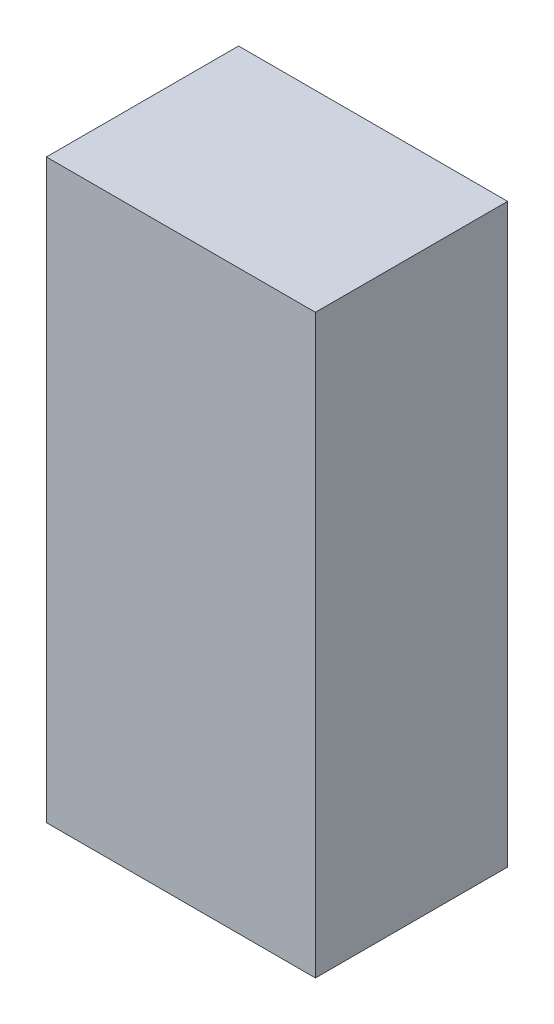
ISO-10303-21;
HEADER;
FILE_DESCRIPTION(('STEP AP214'),'2;1');
FILE_NAME('part.step','',(''),(''),'','','');
FILE_SCHEMA(('AUTOMOTIVE_DESIGN { 1 0 10303 214 1 1 1 1 }'));
ENDSEC;
DATA;
#1=APPLICATION_CONTEXT('core data for automotive mechanical design processes');
#2=APPLICATION_PROTOCOL_DEFINITION('international standard','automotive_design',2000,#1);
#3=PRODUCT_CONTEXT('',#1,'mechanical');
#4=PRODUCT('Part','Part','',(#3));
#5=PRODUCT_RELATED_PRODUCT_CATEGORY('part','',(#4));
#6=PRODUCT_DEFINITION_FORMATION('','',#4);
#7=PRODUCT_DEFINITION_CONTEXT('part definition',#1,'design');
#8=PRODUCT_DEFINITION('design','',#6,#7);
#9=PRODUCT_DEFINITION_SHAPE('','',#8);
#10=(LENGTH_UNIT() NAMED_UNIT(*) SI_UNIT(.MILLI.,.METRE.));
#11=(NAMED_UNIT(*) PLANE_ANGLE_UNIT() SI_UNIT($,.RADIAN.));
#12=(NAMED_UNIT(*) SI_UNIT($,.STERADIAN.) SOLID_ANGLE_UNIT());
#13=UNCERTAINTY_MEASURE_WITH_UNIT(LENGTH_MEASURE(1.E-05),#10,'distance_accuracy_value','');
#14=(GEOMETRIC_REPRESENTATION_CONTEXT(3) GLOBAL_UNCERTAINTY_ASSIGNED_CONTEXT((#13)) GLOBAL_UNIT_ASSIGNED_CONTEXT((#10,
#11,#12)) REPRESENTATION_CONTEXT('',''));
#15=CARTESIAN_POINT('',(0.,0.,0.));
#16=DIRECTION('',(0.,0.,1.));
#17=DIRECTION('',(1.,0.,0.));
#18=AXIS2_PLACEMENT_3D('',#15,#16,#17);
#19=CARTESIAN_POINT('',(-0.6999986,1.49999954,0.));
#20=DIRECTION('',(1.,0.,0.));
#21=DIRECTION('',(0.,-1.,0.));
#22=AXIS2_PLACEMENT_3D('',#19,#20,#21);
#23=PLANE('',#22);
#24=DIRECTION('',(0.,-1.,0.));
#25=VECTOR('',#24,1.);
#26=CARTESIAN_POINT('',(-0.6999986,1.49999954,0.));
#27=LINE('',#26,#25);
#28=CARTESIAN_POINT('',(-0.6999986,1.49999954,0.));
#29=VERTEX_POINT('',#28);
#30=CARTESIAN_POINT('',(-0.6999986,-1.49999954,0.));
#31=VERTEX_POINT('',#30);
#32=EDGE_CURVE('E11',#29,#31,#27,.T.);
#33=ORIENTED_EDGE('',*,*,#32,.T.);
#34=DIRECTION('',(0.,0.,1.));
#35=VECTOR('',#34,1.);
#36=CARTESIAN_POINT('',(-0.6999986,-1.49999954,0.));
#37=LINE('',#36,#35);
#38=CARTESIAN_POINT('',(-0.6999986,-1.49999954,1.00000054));
#39=VERTEX_POINT('',#38);
#40=EDGE_CURVE('E24',#31,#39,#37,.T.);
#41=ORIENTED_EDGE('',*,*,#40,.T.);
#42=DIRECTION('',(0.,-1.,0.));
#43=VECTOR('',#42,1.);
#44=CARTESIAN_POINT('',(-0.6999986,1.49999954,1.00000054));
#45=LINE('',#44,#43);
#46=CARTESIAN_POINT('',(-0.6999986,1.49999954,1.00000054));
#47=VERTEX_POINT('',#46);
#48=EDGE_CURVE('E87',#47,#39,#45,.T.);
#49=ORIENTED_EDGE('',*,*,#48,.F.);
#50=DIRECTION('',(0.,0.,1.));
#51=VECTOR('',#50,1.);
#52=CARTESIAN_POINT('',(-0.6999986,1.49999954,0.));
#53=LINE('',#52,#51);
#54=EDGE_CURVE('E36',#29,#47,#53,.T.);
#55=ORIENTED_EDGE('',*,*,#54,.F.);
#56=EDGE_LOOP('',(#33,#41,#49,#55));
#57=FACE_BOUND('',#56,.T.);
#58=ADVANCED_FACE('F17',(#57),#23,.F.);
#59=CARTESIAN_POINT('',(-0.6999986,-1.49999954,0.));
#60=DIRECTION('',(0.,1.,0.));
#61=DIRECTION('',(1.,0.,0.));
#62=AXIS2_PLACEMENT_3D('',#59,#60,#61);
#63=PLANE('',#62);
#64=DIRECTION('',(1.,0.,0.));
#65=VECTOR('',#64,1.);
#66=CARTESIAN_POINT('',(-0.6999986,-1.49999954,0.));
#67=LINE('',#66,#65);
#68=CARTESIAN_POINT('',(0.70000114,-1.49999954,0.));
#69=VERTEX_POINT('',#68);
#70=EDGE_CURVE('E84',#31,#69,#67,.T.);
#71=ORIENTED_EDGE('',*,*,#70,.T.);
#72=DIRECTION('',(0.,0.,1.));
#73=VECTOR('',#72,1.);
#74=CARTESIAN_POINT('',(0.70000114,-1.49999954,0.));
#75=LINE('',#74,#73);
#76=CARTESIAN_POINT('',(0.70000114,-1.49999954,1.00000054));
#77=VERTEX_POINT('',#76);
#78=EDGE_CURVE('E82',#69,#77,#75,.T.);
#79=ORIENTED_EDGE('',*,*,#78,.T.);
#80=DIRECTION('',(1.,0.,0.));
#81=VECTOR('',#80,1.);
#82=CARTESIAN_POINT('',(-0.6999986,-1.49999954,1.00000054));
#83=LINE('',#82,#81);
#84=EDGE_CURVE('E62',#39,#77,#83,.T.);
#85=ORIENTED_EDGE('',*,*,#84,.F.);
#86=ORIENTED_EDGE('',*,*,#40,.F.);
#87=EDGE_LOOP('',(#71,#79,#85,#86));
#88=FACE_BOUND('',#87,.T.);
#89=ADVANCED_FACE('F89',(#88),#63,.F.);
#90=CARTESIAN_POINT('',(0.70000114,-1.49999954,0.));
#91=DIRECTION('',(-1.,0.,0.));
#92=DIRECTION('',(0.,1.,0.));
#93=AXIS2_PLACEMENT_3D('',#90,#91,#92);
#94=PLANE('',#93);
#95=DIRECTION('',(0.,1.,0.));
#96=VECTOR('',#95,1.);
#97=CARTESIAN_POINT('',(0.70000114,-1.49999954,0.));
#98=LINE('',#97,#96);
#99=CARTESIAN_POINT('',(0.70000114,1.49999954,0.));
#100=VERTEX_POINT('',#99);
#101=EDGE_CURVE('E71',#69,#100,#98,.T.);
#102=ORIENTED_EDGE('',*,*,#101,.T.);
#103=DIRECTION('',(0.,0.,1.));
#104=VECTOR('',#103,1.);
#105=CARTESIAN_POINT('',(0.70000114,1.49999954,0.));
#106=LINE('',#105,#104);
#107=CARTESIAN_POINT('',(0.70000114,1.49999954,1.00000054));
#108=VERTEX_POINT('',#107);
#109=EDGE_CURVE('E65',#100,#108,#106,.T.);
#110=ORIENTED_EDGE('',*,*,#109,.T.);
#111=DIRECTION('',(0.,1.,0.));
#112=VECTOR('',#111,1.);
#113=CARTESIAN_POINT('',(0.70000114,-1.49999954,1.00000054));
#114=LINE('',#113,#112);
#115=EDGE_CURVE('E57',#77,#108,#114,.T.);
#116=ORIENTED_EDGE('',*,*,#115,.F.);
#117=ORIENTED_EDGE('',*,*,#78,.F.);
#118=EDGE_LOOP('',(#102,#110,#116,#117));
#119=FACE_BOUND('',#118,.T.);
#120=ADVANCED_FACE('F69',(#119),#94,.F.);
#121=CARTESIAN_POINT('',(0.70000114,1.49999954,0.));
#122=DIRECTION('',(0.,-1.,0.));
#123=DIRECTION('',(-1.,0.,0.));
#124=AXIS2_PLACEMENT_3D('',#121,#122,#123);
#125=PLANE('',#124);
#126=DIRECTION('',(-1.,0.,0.));
#127=VECTOR('',#126,1.);
#128=CARTESIAN_POINT('',(0.70000114,1.49999954,0.));
#129=LINE('',#128,#127);
#130=EDGE_CURVE('E66',#100,#29,#129,.T.);
#131=ORIENTED_EDGE('',*,*,#130,.T.);
#132=ORIENTED_EDGE('',*,*,#54,.T.);
#133=DIRECTION('',(-1.,0.,0.));
#134=VECTOR('',#133,1.);
#135=CARTESIAN_POINT('',(0.70000114,1.49999954,1.00000054));
#136=LINE('',#135,#134);
#137=EDGE_CURVE('E61',#108,#47,#136,.T.);
#138=ORIENTED_EDGE('',*,*,#137,.F.);
#139=ORIENTED_EDGE('',*,*,#109,.F.);
#140=EDGE_LOOP('',(#131,#132,#138,#139));
#141=FACE_BOUND('',#140,.T.);
#142=ADVANCED_FACE('F76',(#141),#125,.F.);
#143=CARTESIAN_POINT('',(-0.6999986,1.49999954,0.));
#144=DIRECTION('',(0.,0.,-1.));
#145=DIRECTION('',(-1.,0.,0.));
#146=AXIS2_PLACEMENT_3D('',#143,#144,#145);
#147=PLANE('',#146);
#148=ORIENTED_EDGE('',*,*,#130,.F.);
#149=ORIENTED_EDGE('',*,*,#101,.F.);
#150=ORIENTED_EDGE('',*,*,#70,.F.);
#151=ORIENTED_EDGE('',*,*,#32,.F.);
#152=EDGE_LOOP('',(#148,#149,#150,#151));
#153=FACE_BOUND('',#152,.T.);
#154=ADVANCED_FACE('F91',(#153),#147,.T.);
#155=CARTESIAN_POINT('',(-0.6999986,1.49999954,1.00000054));
#156=DIRECTION('',(0.,0.,-1.));
#157=DIRECTION('',(-1.,0.,0.));
#158=AXIS2_PLACEMENT_3D('',#155,#156,#157);
#159=PLANE('',#158);
#160=ORIENTED_EDGE('',*,*,#48,.T.);
#161=ORIENTED_EDGE('',*,*,#84,.T.);
#162=ORIENTED_EDGE('',*,*,#115,.T.);
#163=ORIENTED_EDGE('',*,*,#137,.T.);
#164=EDGE_LOOP('',(#160,#161,#162,#163));
#165=FACE_BOUND('',#164,.T.);
#166=ADVANCED_FACE('F59',(#165),#159,.F.);
#167=CLOSED_SHELL('',(#58,#89,#120,#142,#154,#166));
#168=MANIFOLD_SOLID_BREP('B1',#167);
#169=ADVANCED_BREP_SHAPE_REPRESENTATION('',(#18,#168),#14);
#170=SHAPE_DEFINITION_REPRESENTATION(#9,#169);
ENDSEC;
END-ISO-10303-21;
